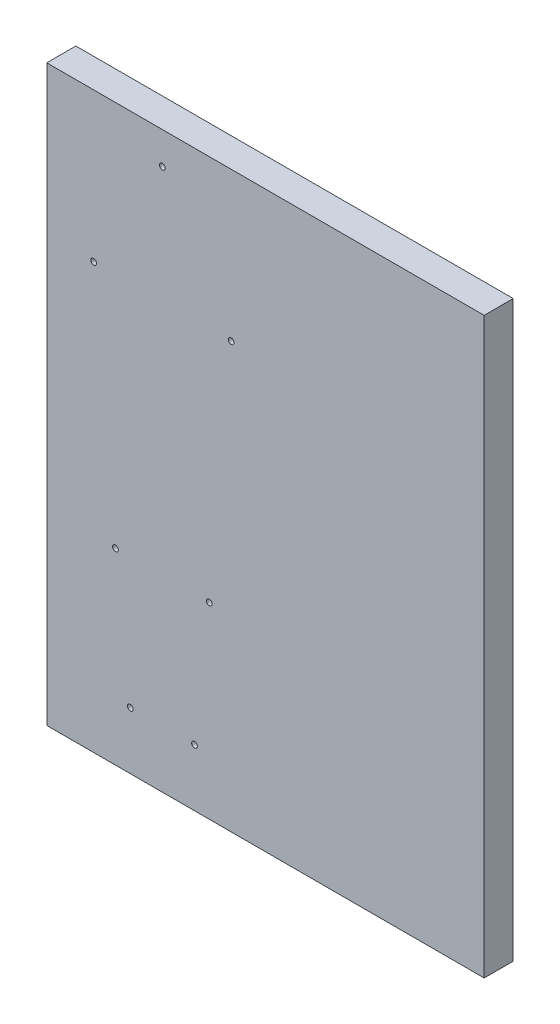
ISO-10303-21;
HEADER;
FILE_DESCRIPTION(('STEP AP214'),'2;1');
FILE_NAME('part.step','',(''),(''),'','','');
FILE_SCHEMA(('AUTOMOTIVE_DESIGN { 1 0 10303 214 1 1 1 1 }'));
ENDSEC;
DATA;
#1=APPLICATION_CONTEXT('core data for automotive mechanical design processes');
#2=APPLICATION_PROTOCOL_DEFINITION('international standard','automotive_design',2000,#1);
#3=PRODUCT_CONTEXT('',#1,'mechanical');
#4=PRODUCT('Part','Part','',(#3));
#5=PRODUCT_RELATED_PRODUCT_CATEGORY('part','',(#4));
#6=PRODUCT_DEFINITION_FORMATION('','',#4);
#7=PRODUCT_DEFINITION_CONTEXT('part definition',#1,'design');
#8=PRODUCT_DEFINITION('design','',#6,#7);
#9=PRODUCT_DEFINITION_SHAPE('','',#8);
#10=(LENGTH_UNIT() NAMED_UNIT(*) SI_UNIT(.MILLI.,.METRE.));
#11=(NAMED_UNIT(*) PLANE_ANGLE_UNIT() SI_UNIT($,.RADIAN.));
#12=(NAMED_UNIT(*) SI_UNIT($,.STERADIAN.) SOLID_ANGLE_UNIT());
#13=UNCERTAINTY_MEASURE_WITH_UNIT(LENGTH_MEASURE(1.E-05),#10,'distance_accuracy_value','');
#14=(GEOMETRIC_REPRESENTATION_CONTEXT(3) GLOBAL_UNCERTAINTY_ASSIGNED_CONTEXT((#13)) GLOBAL_UNIT_ASSIGNED_CONTEXT((#10,
#11,#12)) REPRESENTATION_CONTEXT('',''));
#15=CARTESIAN_POINT('',(0.,0.,0.));
#16=DIRECTION('',(0.,0.,1.));
#17=DIRECTION('',(1.,0.,0.));
#18=AXIS2_PLACEMENT_3D('',#15,#16,#17);
#19=CARTESIAN_POINT('',(0.,0.,0.));
#20=DIRECTION('',(0.,0.,1.));
#21=DIRECTION('',(1.,0.,0.));
#22=AXIS2_PLACEMENT_3D('',#19,#20,#21);
#23=PLANE('',#22);
#24=CARTESIAN_POINT('',(25.,56.,0.));
#25=DIRECTION('',(0.,0.,-1.));
#26=DIRECTION('',(-1.,0.,0.));
#27=AXIS2_PLACEMENT_3D('',#24,#25,#26);
#28=CIRCLE('',#27,1.24999999999902);
#29=CARTESIAN_POINT('',(23.750000000001,56.,0.));
#30=VERTEX_POINT('',#29);
#31=EDGE_CURVE('E207',#30,#30,#28,.T.);
#32=ORIENTED_EDGE('',*,*,#31,.F.);
#33=EDGE_LOOP('',(#32));
#34=FACE_BOUND('',#33,.T.);
#35=CARTESIAN_POINT('',(-5.,4.99999999999999,0.));
#36=DIRECTION('',(0.,0.,-1.));
#37=DIRECTION('',(-1.,0.,0.));
#38=AXIS2_PLACEMENT_3D('',#35,#36,#37);
#39=CIRCLE('',#38,1.24999999999902);
#40=CARTESIAN_POINT('',(-6.24999999999902,4.99999999999999,0.));
#41=VERTEX_POINT('',#40);
#42=EDGE_CURVE('E191',#41,#41,#39,.T.);
#43=ORIENTED_EDGE('',*,*,#42,.F.);
#44=EDGE_LOOP('',(#43));
#45=FACE_BOUND('',#44,.T.);
#46=CARTESIAN_POINT('',(45.4999999999859,-98.6,0.));
#47=DIRECTION('',(0.,0.,-1.));
#48=DIRECTION('',(-1.,0.,0.));
#49=AXIS2_PLACEMENT_3D('',#46,#47,#48);
#50=CIRCLE('',#49,1.24999999999902);
#51=CARTESIAN_POINT('',(44.2499999999869,-98.6,0.));
#52=VERTEX_POINT('',#51);
#53=EDGE_CURVE('E183',#52,#52,#50,.T.);
#54=ORIENTED_EDGE('',*,*,#53,.F.);
#55=EDGE_LOOP('',(#54));
#56=FACE_BOUND('',#55,.T.);
#57=CARTESIAN_POINT('',(4.49999999998587,-98.6,0.));
#58=DIRECTION('',(0.,0.,-1.));
#59=DIRECTION('',(-1.,0.,0.));
#60=AXIS2_PLACEMENT_3D('',#57,#58,#59);
#61=CIRCLE('',#60,1.24999999999902);
#62=CARTESIAN_POINT('',(3.24999999998685,-98.6,0.));
#63=VERTEX_POINT('',#62);
#64=EDGE_CURVE('E175',#63,#63,#61,.T.);
#65=ORIENTED_EDGE('',*,*,#64,.F.);
#66=EDGE_LOOP('',(#65));
#67=FACE_BOUND('',#66,.T.);
#68=CARTESIAN_POINT('',(38.9999999999998,-155.6,0.));
#69=DIRECTION('',(0.,0.,-1.));
#70=DIRECTION('',(-1.,0.,0.));
#71=AXIS2_PLACEMENT_3D('',#68,#69,#70);
#72=CIRCLE('',#71,1.24999999999902);
#73=CARTESIAN_POINT('',(37.7500000000008,-155.6,0.));
#74=VERTEX_POINT('',#73);
#75=EDGE_CURVE('E159',#74,#74,#72,.T.);
#76=ORIENTED_EDGE('',*,*,#75,.F.);
#77=EDGE_LOOP('',(#76));
#78=FACE_BOUND('',#77,.T.);
#79=DIRECTION('',(0.,-1.,0.));
#80=VECTOR('',#79,1.);
#81=CARTESIAN_POINT('',(-25.5,70.,0.));
#82=LINE('',#81,#80);
#83=CARTESIAN_POINT('',(-25.5,70.,0.));
#84=VERTEX_POINT('',#83);
#85=CARTESIAN_POINT('',(-25.5,-180.6,0.));
#86=VERTEX_POINT('',#85);
#87=EDGE_CURVE('E131',#84,#86,#82,.T.);
#88=ORIENTED_EDGE('',*,*,#87,.F.);
#89=DIRECTION('',(-1.,0.,0.));
#90=VECTOR('',#89,1.);
#91=CARTESIAN_POINT('',(-25.5,70.,0.));
#92=LINE('',#91,#90);
#93=CARTESIAN_POINT('',(165.5,70.,0.));
#94=VERTEX_POINT('',#93);
#95=EDGE_CURVE('E101',#94,#84,#92,.T.);
#96=ORIENTED_EDGE('',*,*,#95,.F.);
#97=DIRECTION('',(0.,1.,0.));
#98=VECTOR('',#97,1.);
#99=CARTESIAN_POINT('',(165.5,70.,0.));
#100=LINE('',#99,#98);
#101=CARTESIAN_POINT('',(165.5,-180.6,0.));
#102=VERTEX_POINT('',#101);
#103=EDGE_CURVE('E95',#102,#94,#100,.T.);
#104=ORIENTED_EDGE('',*,*,#103,.F.);
#105=DIRECTION('',(1.,0.,0.));
#106=VECTOR('',#105,1.);
#107=CARTESIAN_POINT('',(-25.5,-180.6,0.));
#108=LINE('',#107,#106);
#109=EDGE_CURVE('E118',#86,#102,#108,.T.);
#110=ORIENTED_EDGE('',*,*,#109,.F.);
#111=EDGE_LOOP('',(#88,#96,#104,#110));
#112=FACE_BOUND('',#111,.T.);
#113=CARTESIAN_POINT('',(10.9999999999998,-155.6,0.));
#114=DIRECTION('',(0.,0.,-1.));
#115=DIRECTION('',(-1.,0.,0.));
#116=AXIS2_PLACEMENT_3D('',#113,#114,#115);
#117=CIRCLE('',#116,1.24999999999902);
#118=CARTESIAN_POINT('',(9.75000000000079,-155.6,0.));
#119=VERTEX_POINT('',#118);
#120=EDGE_CURVE('E167',#119,#119,#117,.T.);
#121=ORIENTED_EDGE('',*,*,#120,.F.);
#122=EDGE_LOOP('',(#121));
#123=FACE_BOUND('',#122,.T.);
#124=CARTESIAN_POINT('',(55.,4.99999999999999,0.));
#125=DIRECTION('',(0.,0.,-1.));
#126=DIRECTION('',(-1.,0.,0.));
#127=AXIS2_PLACEMENT_3D('',#124,#125,#126);
#128=CIRCLE('',#127,1.24999999999902);
#129=CARTESIAN_POINT('',(53.750000000001,4.99999999999999,0.));
#130=VERTEX_POINT('',#129);
#131=EDGE_CURVE('E199',#130,#130,#128,.T.);
#132=ORIENTED_EDGE('',*,*,#131,.F.);
#133=EDGE_LOOP('',(#132));
#134=FACE_BOUND('',#133,.T.);
#135=ADVANCED_FACE('F60',(#34,#45,#56,#67,#78,#112,#123,#134),#23,.F.);
#136=CARTESIAN_POINT('',(-25.5,70.,12.7));
#137=DIRECTION('',(1.,0.,0.));
#138=DIRECTION('',(0.,1.,0.));
#139=AXIS2_PLACEMENT_3D('',#136,#137,#138);
#140=PLANE('',#139);
#141=ORIENTED_EDGE('',*,*,#87,.T.);
#142=DIRECTION('',(0.,0.,-1.));
#143=VECTOR('',#142,1.);
#144=CARTESIAN_POINT('',(-25.5,-180.6,12.7));
#145=LINE('',#144,#143);
#146=CARTESIAN_POINT('',(-25.5,-180.6,12.7));
#147=VERTEX_POINT('',#146);
#148=EDGE_CURVE('E11',#147,#86,#145,.T.);
#149=ORIENTED_EDGE('',*,*,#148,.F.);
#150=DIRECTION('',(0.,-1.,0.));
#151=VECTOR('',#150,1.);
#152=CARTESIAN_POINT('',(-25.5,70.,12.7));
#153=LINE('',#152,#151);
#154=CARTESIAN_POINT('',(-25.5,70.,12.7));
#155=VERTEX_POINT('',#154);
#156=EDGE_CURVE('E113',#155,#147,#153,.T.);
#157=ORIENTED_EDGE('',*,*,#156,.F.);
#158=DIRECTION('',(0.,0.,-1.));
#159=VECTOR('',#158,1.);
#160=CARTESIAN_POINT('',(-25.5,70.,12.7));
#161=LINE('',#160,#159);
#162=EDGE_CURVE('E127',#155,#84,#161,.T.);
#163=ORIENTED_EDGE('',*,*,#162,.T.);
#164=EDGE_LOOP('',(#141,#149,#157,#163));
#165=FACE_BOUND('',#164,.T.);
#166=ADVANCED_FACE('F62',(#165),#140,.F.);
#167=CARTESIAN_POINT('',(-25.5,-180.6,12.7));
#168=DIRECTION('',(0.,1.,0.));
#169=DIRECTION('',(0.,0.,1.));
#170=AXIS2_PLACEMENT_3D('',#167,#168,#169);
#171=PLANE('',#170);
#172=ORIENTED_EDGE('',*,*,#109,.T.);
#173=DIRECTION('',(0.,0.,-1.));
#174=VECTOR('',#173,1.);
#175=CARTESIAN_POINT('',(165.5,-180.6,12.7));
#176=LINE('',#175,#174);
#177=CARTESIAN_POINT('',(165.5,-180.6,12.7));
#178=VERTEX_POINT('',#177);
#179=EDGE_CURVE('E70',#178,#102,#176,.T.);
#180=ORIENTED_EDGE('',*,*,#179,.F.);
#181=DIRECTION('',(1.,0.,0.));
#182=VECTOR('',#181,1.);
#183=CARTESIAN_POINT('',(-25.5,-180.6,12.7));
#184=LINE('',#183,#182);
#185=EDGE_CURVE('E108',#147,#178,#184,.T.);
#186=ORIENTED_EDGE('',*,*,#185,.F.);
#187=ORIENTED_EDGE('',*,*,#148,.T.);
#188=EDGE_LOOP('',(#172,#180,#186,#187));
#189=FACE_BOUND('',#188,.T.);
#190=ADVANCED_FACE('F117',(#189),#171,.F.);
#191=CARTESIAN_POINT('',(165.5,70.,12.7));
#192=DIRECTION('',(-1.,0.,0.));
#193=DIRECTION('',(0.,-1.,0.));
#194=AXIS2_PLACEMENT_3D('',#191,#192,#193);
#195=PLANE('',#194);
#196=ORIENTED_EDGE('',*,*,#103,.T.);
#197=DIRECTION('',(0.,0.,-1.));
#198=VECTOR('',#197,1.);
#199=CARTESIAN_POINT('',(165.5,70.,12.7));
#200=LINE('',#199,#198);
#201=CARTESIAN_POINT('',(165.5,70.,12.7));
#202=VERTEX_POINT('',#201);
#203=EDGE_CURVE('E120',#202,#94,#200,.T.);
#204=ORIENTED_EDGE('',*,*,#203,.F.);
#205=DIRECTION('',(0.,1.,0.));
#206=VECTOR('',#205,1.);
#207=CARTESIAN_POINT('',(165.5,70.,12.7));
#208=LINE('',#207,#206);
#209=EDGE_CURVE('E111',#178,#202,#208,.T.);
#210=ORIENTED_EDGE('',*,*,#209,.F.);
#211=ORIENTED_EDGE('',*,*,#179,.T.);
#212=EDGE_LOOP('',(#196,#204,#210,#211));
#213=FACE_BOUND('',#212,.T.);
#214=ADVANCED_FACE('F121',(#213),#195,.F.);
#215=CARTESIAN_POINT('',(-25.5,70.,12.7));
#216=DIRECTION('',(0.,-1.,0.));
#217=DIRECTION('',(0.,0.,-1.));
#218=AXIS2_PLACEMENT_3D('',#215,#216,#217);
#219=PLANE('',#218);
#220=ORIENTED_EDGE('',*,*,#95,.T.);
#221=ORIENTED_EDGE('',*,*,#162,.F.);
#222=DIRECTION('',(-1.,0.,0.));
#223=VECTOR('',#222,1.);
#224=CARTESIAN_POINT('',(-25.5,70.,12.7));
#225=LINE('',#224,#223);
#226=EDGE_CURVE('E78',#202,#155,#225,.T.);
#227=ORIENTED_EDGE('',*,*,#226,.F.);
#228=ORIENTED_EDGE('',*,*,#203,.T.);
#229=EDGE_LOOP('',(#220,#221,#227,#228));
#230=FACE_BOUND('',#229,.T.);
#231=ADVANCED_FACE('F147',(#230),#219,.F.);
#232=CARTESIAN_POINT('',(0.,0.,12.7));
#233=DIRECTION('',(0.,0.,1.));
#234=DIRECTION('',(1.,0.,0.));
#235=AXIS2_PLACEMENT_3D('',#232,#233,#234);
#236=PLANE('',#235);
#237=CARTESIAN_POINT('',(25.,56.,12.6999999999997));
#238=DIRECTION('',(0.,0.,-1.));
#239=DIRECTION('',(-1.,0.,0.));
#240=AXIS2_PLACEMENT_3D('',#237,#238,#239);
#241=CIRCLE('',#240,1.24999999999902);
#242=CARTESIAN_POINT('',(23.750000000001,56.,12.6999999999997));
#243=VERTEX_POINT('',#242);
#244=EDGE_CURVE('E203',#243,#243,#241,.T.);
#245=ORIENTED_EDGE('',*,*,#244,.T.);
#246=EDGE_LOOP('',(#245));
#247=FACE_BOUND('',#246,.T.);
#248=CARTESIAN_POINT('',(55.,4.99999999999999,12.6999999999997));
#249=DIRECTION('',(0.,0.,-1.));
#250=DIRECTION('',(-1.,0.,0.));
#251=AXIS2_PLACEMENT_3D('',#248,#249,#250);
#252=CIRCLE('',#251,1.24999999999902);
#253=CARTESIAN_POINT('',(53.750000000001,4.99999999999999,12.6999999999997));
#254=VERTEX_POINT('',#253);
#255=EDGE_CURVE('E195',#254,#254,#252,.T.);
#256=ORIENTED_EDGE('',*,*,#255,.T.);
#257=EDGE_LOOP('',(#256));
#258=FACE_BOUND('',#257,.T.);
#259=CARTESIAN_POINT('',(-5.,4.99999999999999,12.6999999999997));
#260=DIRECTION('',(0.,0.,-1.));
#261=DIRECTION('',(-1.,0.,0.));
#262=AXIS2_PLACEMENT_3D('',#259,#260,#261);
#263=CIRCLE('',#262,1.24999999999902);
#264=CARTESIAN_POINT('',(-6.24999999999902,4.99999999999999,12.6999999999997));
#265=VERTEX_POINT('',#264);
#266=EDGE_CURVE('E187',#265,#265,#263,.T.);
#267=ORIENTED_EDGE('',*,*,#266,.T.);
#268=EDGE_LOOP('',(#267));
#269=FACE_BOUND('',#268,.T.);
#270=CARTESIAN_POINT('',(45.4999999999859,-98.6,12.6999999999997));
#271=DIRECTION('',(0.,0.,-1.));
#272=DIRECTION('',(-1.,0.,0.));
#273=AXIS2_PLACEMENT_3D('',#270,#271,#272);
#274=CIRCLE('',#273,1.24999999999902);
#275=CARTESIAN_POINT('',(44.2499999999869,-98.6,12.6999999999997));
#276=VERTEX_POINT('',#275);
#277=EDGE_CURVE('E179',#276,#276,#274,.T.);
#278=ORIENTED_EDGE('',*,*,#277,.T.);
#279=EDGE_LOOP('',(#278));
#280=FACE_BOUND('',#279,.T.);
#281=CARTESIAN_POINT('',(4.49999999998587,-98.6,12.6999999999997));
#282=DIRECTION('',(0.,0.,-1.));
#283=DIRECTION('',(-1.,0.,0.));
#284=AXIS2_PLACEMENT_3D('',#281,#282,#283);
#285=CIRCLE('',#284,1.24999999999902);
#286=CARTESIAN_POINT('',(3.24999999998686,-98.6,12.6999999999997));
#287=VERTEX_POINT('',#286);
#288=EDGE_CURVE('E171',#287,#287,#285,.T.);
#289=ORIENTED_EDGE('',*,*,#288,.T.);
#290=EDGE_LOOP('',(#289));
#291=FACE_BOUND('',#290,.T.);
#292=CARTESIAN_POINT('',(10.9999999999998,-155.6,12.6999999999997));
#293=DIRECTION('',(0.,0.,-1.));
#294=DIRECTION('',(-1.,0.,0.));
#295=AXIS2_PLACEMENT_3D('',#292,#293,#294);
#296=CIRCLE('',#295,1.24999999999902);
#297=CARTESIAN_POINT('',(9.75000000000079,-155.6,12.6999999999997));
#298=VERTEX_POINT('',#297);
#299=EDGE_CURVE('E163',#298,#298,#296,.T.);
#300=ORIENTED_EDGE('',*,*,#299,.T.);
#301=EDGE_LOOP('',(#300));
#302=FACE_BOUND('',#301,.T.);
#303=CARTESIAN_POINT('',(38.9999999999998,-155.6,12.6999999999997));
#304=DIRECTION('',(0.,0.,-1.));
#305=DIRECTION('',(-1.,0.,0.));
#306=AXIS2_PLACEMENT_3D('',#303,#304,#305);
#307=CIRCLE('',#306,1.24999999999902);
#308=CARTESIAN_POINT('',(37.7500000000008,-155.6,12.6999999999997));
#309=VERTEX_POINT('',#308);
#310=EDGE_CURVE('E135',#309,#309,#307,.T.);
#311=ORIENTED_EDGE('',*,*,#310,.T.);
#312=EDGE_LOOP('',(#311));
#313=FACE_BOUND('',#312,.T.);
#314=ORIENTED_EDGE('',*,*,#156,.T.);
#315=ORIENTED_EDGE('',*,*,#185,.T.);
#316=ORIENTED_EDGE('',*,*,#209,.T.);
#317=ORIENTED_EDGE('',*,*,#226,.T.);
#318=EDGE_LOOP('',(#314,#315,#316,#317));
#319=FACE_BOUND('',#318,.T.);
#320=ADVANCED_FACE('F109',(#247,#258,#269,#280,#291,#302,#313,#319),#236,.T.);
#321=CARTESIAN_POINT('',(38.9999999999998,-155.6,0.));
#322=DIRECTION('',(0.,0.,-1.));
#323=DIRECTION('',(-1.,0.,0.));
#324=AXIS2_PLACEMENT_3D('',#321,#322,#323);
#325=CYLINDRICAL_SURFACE('',#324,1.24999999999902);
#326=ORIENTED_EDGE('',*,*,#310,.F.);
#327=EDGE_LOOP('',(#326));
#328=FACE_BOUND('',#327,.T.);
#329=ORIENTED_EDGE('',*,*,#75,.T.);
#330=EDGE_LOOP('',(#329));
#331=FACE_BOUND('',#330,.T.);
#332=ADVANCED_FACE('F227',(#328,#331),#325,.F.);
#333=CARTESIAN_POINT('',(10.9999999999998,-155.6,0.));
#334=DIRECTION('',(0.,0.,-1.));
#335=DIRECTION('',(-1.,0.,0.));
#336=AXIS2_PLACEMENT_3D('',#333,#334,#335);
#337=CYLINDRICAL_SURFACE('',#336,1.24999999999902);
#338=ORIENTED_EDGE('',*,*,#299,.F.);
#339=EDGE_LOOP('',(#338));
#340=FACE_BOUND('',#339,.T.);
#341=ORIENTED_EDGE('',*,*,#120,.T.);
#342=EDGE_LOOP('',(#341));
#343=FACE_BOUND('',#342,.T.);
#344=ADVANCED_FACE('F229',(#340,#343),#337,.F.);
#345=CARTESIAN_POINT('',(4.49999999998587,-98.6,0.));
#346=DIRECTION('',(0.,0.,-1.));
#347=DIRECTION('',(-1.,0.,0.));
#348=AXIS2_PLACEMENT_3D('',#345,#346,#347);
#349=CYLINDRICAL_SURFACE('',#348,1.24999999999902);
#350=ORIENTED_EDGE('',*,*,#288,.F.);
#351=EDGE_LOOP('',(#350));
#352=FACE_BOUND('',#351,.T.);
#353=ORIENTED_EDGE('',*,*,#64,.T.);
#354=EDGE_LOOP('',(#353));
#355=FACE_BOUND('',#354,.T.);
#356=ADVANCED_FACE('F235',(#352,#355),#349,.F.);
#357=CARTESIAN_POINT('',(45.4999999999859,-98.6,0.));
#358=DIRECTION('',(0.,0.,-1.));
#359=DIRECTION('',(-1.,0.,0.));
#360=AXIS2_PLACEMENT_3D('',#357,#358,#359);
#361=CYLINDRICAL_SURFACE('',#360,1.24999999999902);
#362=ORIENTED_EDGE('',*,*,#277,.F.);
#363=EDGE_LOOP('',(#362));
#364=FACE_BOUND('',#363,.T.);
#365=ORIENTED_EDGE('',*,*,#53,.T.);
#366=EDGE_LOOP('',(#365));
#367=FACE_BOUND('',#366,.T.);
#368=ADVANCED_FACE('F311',(#364,#367),#361,.F.);
#369=CARTESIAN_POINT('',(-5.,4.99999999999999,0.));
#370=DIRECTION('',(0.,0.,-1.));
#371=DIRECTION('',(-1.,0.,0.));
#372=AXIS2_PLACEMENT_3D('',#369,#370,#371);
#373=CYLINDRICAL_SURFACE('',#372,1.24999999999902);
#374=ORIENTED_EDGE('',*,*,#266,.F.);
#375=EDGE_LOOP('',(#374));
#376=FACE_BOUND('',#375,.T.);
#377=ORIENTED_EDGE('',*,*,#42,.T.);
#378=EDGE_LOOP('',(#377));
#379=FACE_BOUND('',#378,.T.);
#380=ADVANCED_FACE('F322',(#376,#379),#373,.F.);
#381=CARTESIAN_POINT('',(55.,4.99999999999999,0.));
#382=DIRECTION('',(0.,0.,-1.));
#383=DIRECTION('',(-1.,0.,0.));
#384=AXIS2_PLACEMENT_3D('',#381,#382,#383);
#385=CYLINDRICAL_SURFACE('',#384,1.24999999999902);
#386=ORIENTED_EDGE('',*,*,#255,.F.);
#387=EDGE_LOOP('',(#386));
#388=FACE_BOUND('',#387,.T.);
#389=ORIENTED_EDGE('',*,*,#131,.T.);
#390=EDGE_LOOP('',(#389));
#391=FACE_BOUND('',#390,.T.);
#392=ADVANCED_FACE('F334',(#388,#391),#385,.F.);
#393=CARTESIAN_POINT('',(25.,56.,0.));
#394=DIRECTION('',(0.,0.,-1.));
#395=DIRECTION('',(-1.,0.,0.));
#396=AXIS2_PLACEMENT_3D('',#393,#394,#395);
#397=CYLINDRICAL_SURFACE('',#396,1.24999999999902);
#398=ORIENTED_EDGE('',*,*,#244,.F.);
#399=EDGE_LOOP('',(#398));
#400=FACE_BOUND('',#399,.T.);
#401=ORIENTED_EDGE('',*,*,#31,.T.);
#402=EDGE_LOOP('',(#401));
#403=FACE_BOUND('',#402,.T.);
#404=ADVANCED_FACE('F214',(#400,#403),#397,.F.);
#405=CLOSED_SHELL('',(#135,#166,#190,#214,#231,#320,#332,#344,#356,#368,#380,#392,#404));
#406=MANIFOLD_SOLID_BREP('B2',#405);
#407=ADVANCED_BREP_SHAPE_REPRESENTATION('',(#18,#406),#14);
#408=SHAPE_DEFINITION_REPRESENTATION(#9,#407);
ENDSEC;
END-ISO-10303-21;
